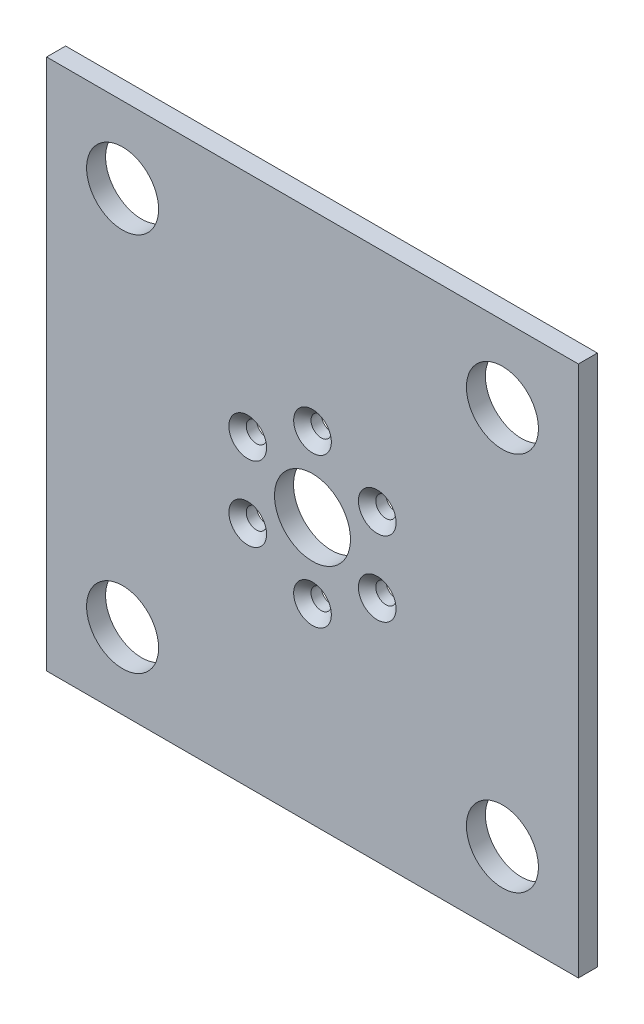
ISO-10303-21;
HEADER;
FILE_DESCRIPTION(('STEP AP214'),'2;1');
FILE_NAME('part.step','',(''),(''),'','','');
FILE_SCHEMA(('AUTOMOTIVE_DESIGN { 1 0 10303 214 1 1 1 1 }'));
ENDSEC;
DATA;
#1=APPLICATION_CONTEXT('core data for automotive mechanical design processes');
#2=APPLICATION_PROTOCOL_DEFINITION('international standard','automotive_design',2000,#1);
#3=PRODUCT_CONTEXT('',#1,'mechanical');
#4=PRODUCT('Part','Part','',(#3));
#5=PRODUCT_RELATED_PRODUCT_CATEGORY('part','',(#4));
#6=PRODUCT_DEFINITION_FORMATION('','',#4);
#7=PRODUCT_DEFINITION_CONTEXT('part definition',#1,'design');
#8=PRODUCT_DEFINITION('design','',#6,#7);
#9=PRODUCT_DEFINITION_SHAPE('','',#8);
#10=(LENGTH_UNIT() NAMED_UNIT(*) SI_UNIT(.MILLI.,.METRE.));
#11=(NAMED_UNIT(*) PLANE_ANGLE_UNIT() SI_UNIT($,.RADIAN.));
#12=(NAMED_UNIT(*) SI_UNIT($,.STERADIAN.) SOLID_ANGLE_UNIT());
#13=UNCERTAINTY_MEASURE_WITH_UNIT(LENGTH_MEASURE(1.E-05),#10,'distance_accuracy_value','');
#14=(GEOMETRIC_REPRESENTATION_CONTEXT(3) GLOBAL_UNCERTAINTY_ASSIGNED_CONTEXT((#13)) GLOBAL_UNIT_ASSIGNED_CONTEXT((#10,
#11,#12)) REPRESENTATION_CONTEXT('',''));
#15=CARTESIAN_POINT('',(0.,0.,0.));
#16=DIRECTION('',(0.,0.,1.));
#17=DIRECTION('',(1.,0.,0.));
#18=AXIS2_PLACEMENT_3D('',#15,#16,#17);
#19=CARTESIAN_POINT('',(44.45,44.45,3.175));
#20=DIRECTION('',(0.,0.,-1.));
#21=DIRECTION('',(-1.,0.,0.));
#22=AXIS2_PLACEMENT_3D('',#19,#20,#21);
#23=PLANE('',#22);
#24=CARTESIAN_POINT('',(-31.75,-31.75,3.175));
#25=DIRECTION('',(0.,0.,-1.));
#26=DIRECTION('',(1.,0.,0.));
#27=AXIS2_PLACEMENT_3D('',#24,#25,#26);
#28=CIRCLE('',#27,6.01891974300622);
#29=CARTESIAN_POINT('',(-25.7310802569938,-31.75,3.175));
#30=VERTEX_POINT('',#29);
#31=EDGE_CURVE('E133',#30,#30,#28,.T.);
#32=ORIENTED_EDGE('',*,*,#31,.T.);
#33=EDGE_LOOP('',(#32));
#34=FACE_BOUND('',#33,.T.);
#35=CARTESIAN_POINT('',(31.75,-31.75,3.175));
#36=DIRECTION('',(0.,0.,1.));
#37=DIRECTION('',(-1.,0.,0.));
#38=AXIS2_PLACEMENT_3D('',#35,#36,#37);
#39=CIRCLE('',#38,6.01891974300622);
#40=CARTESIAN_POINT('',(25.7310802569938,-31.75,3.175));
#41=VERTEX_POINT('',#40);
#42=EDGE_CURVE('E127',#41,#41,#39,.T.);
#43=ORIENTED_EDGE('',*,*,#42,.F.);
#44=EDGE_LOOP('',(#43));
#45=FACE_BOUND('',#44,.T.);
#46=DIRECTION('',(0.,1.,0.));
#47=VECTOR('',#46,1.);
#48=CARTESIAN_POINT('',(44.45,-44.45,3.175));
#49=LINE('',#48,#47);
#50=CARTESIAN_POINT('',(44.45,-44.45,3.175));
#51=VERTEX_POINT('',#50);
#52=CARTESIAN_POINT('',(44.45,44.45,3.175));
#53=VERTEX_POINT('',#52);
#54=EDGE_CURVE('E88',#51,#53,#49,.T.);
#55=ORIENTED_EDGE('',*,*,#54,.T.);
#56=DIRECTION('',(-1.,0.,0.));
#57=VECTOR('',#56,1.);
#58=CARTESIAN_POINT('',(-44.45,44.45,3.175));
#59=LINE('',#58,#57);
#60=CARTESIAN_POINT('',(-44.45,44.45,3.175));
#61=VERTEX_POINT('',#60);
#62=EDGE_CURVE('E83',#53,#61,#59,.T.);
#63=ORIENTED_EDGE('',*,*,#62,.T.);
#64=DIRECTION('',(0.,-1.,0.));
#65=VECTOR('',#64,1.);
#66=CARTESIAN_POINT('',(-44.45,-44.45,3.175));
#67=LINE('',#66,#65);
#68=CARTESIAN_POINT('',(-44.45,-44.45,3.175));
#69=VERTEX_POINT('',#68);
#70=EDGE_CURVE('E86',#61,#69,#67,.T.);
#71=ORIENTED_EDGE('',*,*,#70,.T.);
#72=DIRECTION('',(1.,0.,0.));
#73=VECTOR('',#72,1.);
#74=CARTESIAN_POINT('',(-44.45,-44.45,3.175));
#75=LINE('',#74,#73);
#76=EDGE_CURVE('E53',#69,#51,#75,.T.);
#77=ORIENTED_EDGE('',*,*,#76,.T.);
#78=EDGE_LOOP('',(#55,#63,#71,#77));
#79=FACE_BOUND('',#78,.T.);
#80=CARTESIAN_POINT('',(-31.75,31.75,3.175));
#81=DIRECTION('',(0.,0.,1.));
#82=DIRECTION('',(1.,0.,0.));
#83=AXIS2_PLACEMENT_3D('',#80,#81,#82);
#84=CIRCLE('',#83,6.01891974300622);
#85=CARTESIAN_POINT('',(-25.7310802569938,31.75,3.175));
#86=VERTEX_POINT('',#85);
#87=EDGE_CURVE('E115',#86,#86,#84,.T.);
#88=ORIENTED_EDGE('',*,*,#87,.F.);
#89=EDGE_LOOP('',(#88));
#90=FACE_BOUND('',#89,.T.);
#91=CARTESIAN_POINT('',(31.75,31.75,3.175));
#92=DIRECTION('',(0.,0.,-1.));
#93=DIRECTION('',(-1.,0.,0.));
#94=AXIS2_PLACEMENT_3D('',#91,#92,#93);
#95=CIRCLE('',#94,6.01891974300622);
#96=CARTESIAN_POINT('',(25.7310802569938,31.75,3.175));
#97=VERTEX_POINT('',#96);
#98=EDGE_CURVE('E121',#97,#97,#95,.T.);
#99=ORIENTED_EDGE('',*,*,#98,.T.);
#100=EDGE_LOOP('',(#99));
#101=FACE_BOUND('',#100,.T.);
#102=CARTESIAN_POINT('',(0.,0.,3.175));
#103=DIRECTION('',(0.,0.,1.));
#104=DIRECTION('',(1.,0.,0.));
#105=AXIS2_PLACEMENT_3D('',#102,#103,#104);
#106=CIRCLE('',#105,6.35);
#107=CARTESIAN_POINT('',(6.35,0.,3.175));
#108=VERTEX_POINT('',#107);
#109=EDGE_CURVE('E139',#108,#108,#106,.T.);
#110=ORIENTED_EDGE('',*,*,#109,.F.);
#111=EDGE_LOOP('',(#110));
#112=FACE_BOUND('',#111,.T.);
#113=CARTESIAN_POINT('',(0.,12.5,3.175));
#114=DIRECTION('',(0.,0.,1.));
#115=DIRECTION('',(1.,0.,0.));
#116=AXIS2_PLACEMENT_3D('',#113,#114,#115);
#117=CIRCLE('',#116,3.15);
#118=CARTESIAN_POINT('',(3.15,12.5,3.175));
#119=VERTEX_POINT('',#118);
#120=EDGE_CURVE('E150',#119,#119,#117,.T.);
#121=ORIENTED_EDGE('',*,*,#120,.F.);
#122=EDGE_LOOP('',(#121));
#123=FACE_BOUND('',#122,.T.);
#124=CARTESIAN_POINT('',(-10.8253175473055,6.24999999999998,3.175));
#125=DIRECTION('',(0.,0.,1.));
#126=DIRECTION('',(1.,0.,0.));
#127=AXIS2_PLACEMENT_3D('',#124,#125,#126);
#128=CIRCLE('',#127,3.15);
#129=CARTESIAN_POINT('',(-7.6753175473055,6.24999999999998,3.175));
#130=VERTEX_POINT('',#129);
#131=EDGE_CURVE('E159',#130,#130,#128,.T.);
#132=ORIENTED_EDGE('',*,*,#131,.F.);
#133=EDGE_LOOP('',(#132));
#134=FACE_BOUND('',#133,.T.);
#135=CARTESIAN_POINT('',(-10.8253175473055,-6.25000000000005,3.175));
#136=DIRECTION('',(0.,0.,1.));
#137=DIRECTION('',(1.,0.,0.));
#138=AXIS2_PLACEMENT_3D('',#135,#136,#137);
#139=CIRCLE('',#138,3.15);
#140=CARTESIAN_POINT('',(-7.67531754730546,-6.25000000000005,3.175));
#141=VERTEX_POINT('',#140);
#142=EDGE_CURVE('E168',#141,#141,#139,.T.);
#143=ORIENTED_EDGE('',*,*,#142,.F.);
#144=EDGE_LOOP('',(#143));
#145=FACE_BOUND('',#144,.T.);
#146=CARTESIAN_POINT('',(0.,-12.5,3.175));
#147=DIRECTION('',(0.,0.,1.));
#148=DIRECTION('',(1.,0.,0.));
#149=AXIS2_PLACEMENT_3D('',#146,#147,#148);
#150=CIRCLE('',#149,3.15);
#151=CARTESIAN_POINT('',(3.15,-12.5,3.175));
#152=VERTEX_POINT('',#151);
#153=EDGE_CURVE('E177',#152,#152,#150,.T.);
#154=ORIENTED_EDGE('',*,*,#153,.F.);
#155=EDGE_LOOP('',(#154));
#156=FACE_BOUND('',#155,.T.);
#157=CARTESIAN_POINT('',(10.8253175473055,-6.2499999999999,3.175));
#158=DIRECTION('',(0.,0.,1.));
#159=DIRECTION('',(1.,0.,0.));
#160=AXIS2_PLACEMENT_3D('',#157,#158,#159);
#161=CIRCLE('',#160,3.15);
#162=CARTESIAN_POINT('',(13.9753175473055,-6.2499999999999,3.175));
#163=VERTEX_POINT('',#162);
#164=EDGE_CURVE('E186',#163,#163,#161,.T.);
#165=ORIENTED_EDGE('',*,*,#164,.F.);
#166=EDGE_LOOP('',(#165));
#167=FACE_BOUND('',#166,.T.);
#168=CARTESIAN_POINT('',(10.8253175473054,6.25000000000013,3.175));
#169=DIRECTION('',(0.,0.,1.));
#170=DIRECTION('',(1.,0.,0.));
#171=AXIS2_PLACEMENT_3D('',#168,#169,#170);
#172=CIRCLE('',#171,3.15);
#173=CARTESIAN_POINT('',(13.9753175473054,6.25000000000013,3.175));
#174=VERTEX_POINT('',#173);
#175=EDGE_CURVE('E195',#174,#174,#172,.T.);
#176=ORIENTED_EDGE('',*,*,#175,.F.);
#177=EDGE_LOOP('',(#176));
#178=FACE_BOUND('',#177,.T.);
#179=ADVANCED_FACE('F36',(#34,#45,#79,#90,#101,#112,#123,#134,#145,#156,#167,#178),#23,.F.);
#180=CARTESIAN_POINT('',(44.45,44.45,0.));
#181=DIRECTION('',(0.,0.,-1.));
#182=DIRECTION('',(-1.,0.,0.));
#183=AXIS2_PLACEMENT_3D('',#180,#181,#182);
#184=PLANE('',#183);
#185=CARTESIAN_POINT('',(10.8253175473054,6.25000000000013,0.));
#186=DIRECTION('',(0.,0.,1.));
#187=DIRECTION('',(1.,0.,0.));
#188=AXIS2_PLACEMENT_3D('',#185,#186,#187);
#189=CIRCLE('',#188,1.7);
#190=CARTESIAN_POINT('',(12.5253175473054,6.25000000000013,0.));
#191=VERTEX_POINT('',#190);
#192=EDGE_CURVE('E189',#191,#191,#189,.T.);
#193=ORIENTED_EDGE('',*,*,#192,.T.);
#194=EDGE_LOOP('',(#193));
#195=FACE_BOUND('',#194,.T.);
#196=CARTESIAN_POINT('',(0.,-12.5,0.));
#197=DIRECTION('',(0.,0.,1.));
#198=DIRECTION('',(1.,0.,0.));
#199=AXIS2_PLACEMENT_3D('',#196,#197,#198);
#200=CIRCLE('',#199,1.7);
#201=CARTESIAN_POINT('',(1.7,-12.5,0.));
#202=VERTEX_POINT('',#201);
#203=EDGE_CURVE('E171',#202,#202,#200,.T.);
#204=ORIENTED_EDGE('',*,*,#203,.T.);
#205=EDGE_LOOP('',(#204));
#206=FACE_BOUND('',#205,.T.);
#207=CARTESIAN_POINT('',(-10.8253175473055,-6.25000000000005,0.));
#208=DIRECTION('',(0.,0.,1.));
#209=DIRECTION('',(1.,0.,0.));
#210=AXIS2_PLACEMENT_3D('',#207,#208,#209);
#211=CIRCLE('',#210,1.7);
#212=CARTESIAN_POINT('',(-9.12531754730546,-6.25000000000005,0.));
#213=VERTEX_POINT('',#212);
#214=EDGE_CURVE('E162',#213,#213,#211,.T.);
#215=ORIENTED_EDGE('',*,*,#214,.T.);
#216=EDGE_LOOP('',(#215));
#217=FACE_BOUND('',#216,.T.);
#218=CARTESIAN_POINT('',(-10.8253175473055,6.24999999999998,0.));
#219=DIRECTION('',(0.,0.,1.));
#220=DIRECTION('',(1.,0.,0.));
#221=AXIS2_PLACEMENT_3D('',#218,#219,#220);
#222=CIRCLE('',#221,1.7);
#223=CARTESIAN_POINT('',(-9.1253175473055,6.24999999999998,0.));
#224=VERTEX_POINT('',#223);
#225=EDGE_CURVE('E153',#224,#224,#222,.T.);
#226=ORIENTED_EDGE('',*,*,#225,.T.);
#227=EDGE_LOOP('',(#226));
#228=FACE_BOUND('',#227,.T.);
#229=CARTESIAN_POINT('',(0.,12.5,0.));
#230=DIRECTION('',(0.,0.,1.));
#231=DIRECTION('',(1.,0.,0.));
#232=AXIS2_PLACEMENT_3D('',#229,#230,#231);
#233=CIRCLE('',#232,1.7);
#234=CARTESIAN_POINT('',(1.7,12.5,0.));
#235=VERTEX_POINT('',#234);
#236=EDGE_CURVE('E142',#235,#235,#233,.T.);
#237=ORIENTED_EDGE('',*,*,#236,.T.);
#238=EDGE_LOOP('',(#237));
#239=FACE_BOUND('',#238,.T.);
#240=CARTESIAN_POINT('',(0.,0.,0.));
#241=DIRECTION('',(0.,0.,1.));
#242=DIRECTION('',(1.,0.,0.));
#243=AXIS2_PLACEMENT_3D('',#240,#241,#242);
#244=CIRCLE('',#243,6.35);
#245=CARTESIAN_POINT('',(6.35,0.,0.));
#246=VERTEX_POINT('',#245);
#247=EDGE_CURVE('E136',#246,#246,#244,.T.);
#248=ORIENTED_EDGE('',*,*,#247,.T.);
#249=EDGE_LOOP('',(#248));
#250=FACE_BOUND('',#249,.T.);
#251=CARTESIAN_POINT('',(31.75,31.75,0.));
#252=DIRECTION('',(0.,0.,-1.));
#253=DIRECTION('',(-1.,0.,0.));
#254=AXIS2_PLACEMENT_3D('',#251,#252,#253);
#255=CIRCLE('',#254,6.01891974300622);
#256=CARTESIAN_POINT('',(25.7310802569938,31.75,0.));
#257=VERTEX_POINT('',#256);
#258=EDGE_CURVE('E118',#257,#257,#255,.T.);
#259=ORIENTED_EDGE('',*,*,#258,.F.);
#260=EDGE_LOOP('',(#259));
#261=FACE_BOUND('',#260,.T.);
#262=CARTESIAN_POINT('',(-31.75,31.75,0.));
#263=DIRECTION('',(0.,0.,1.));
#264=DIRECTION('',(1.,0.,0.));
#265=AXIS2_PLACEMENT_3D('',#262,#263,#264);
#266=CIRCLE('',#265,6.01891974300622);
#267=CARTESIAN_POINT('',(-25.7310802569938,31.75,0.));
#268=VERTEX_POINT('',#267);
#269=EDGE_CURVE('E103',#268,#268,#266,.T.);
#270=ORIENTED_EDGE('',*,*,#269,.T.);
#271=EDGE_LOOP('',(#270));
#272=FACE_BOUND('',#271,.T.);
#273=DIRECTION('',(0.,1.,0.));
#274=VECTOR('',#273,1.);
#275=CARTESIAN_POINT('',(44.45,-44.45,0.));
#276=LINE('',#275,#274);
#277=CARTESIAN_POINT('',(44.45,-44.45,0.));
#278=VERTEX_POINT('',#277);
#279=CARTESIAN_POINT('',(44.45,44.45,0.));
#280=VERTEX_POINT('',#279);
#281=EDGE_CURVE('E100',#278,#280,#276,.T.);
#282=ORIENTED_EDGE('',*,*,#281,.F.);
#283=DIRECTION('',(1.,0.,0.));
#284=VECTOR('',#283,1.);
#285=CARTESIAN_POINT('',(-44.45,-44.45,0.));
#286=LINE('',#285,#284);
#287=CARTESIAN_POINT('',(-44.45,-44.45,0.));
#288=VERTEX_POINT('',#287);
#289=EDGE_CURVE('E76',#288,#278,#286,.T.);
#290=ORIENTED_EDGE('',*,*,#289,.F.);
#291=DIRECTION('',(0.,-1.,0.));
#292=VECTOR('',#291,1.);
#293=CARTESIAN_POINT('',(-44.45,-44.45,0.));
#294=LINE('',#293,#292);
#295=CARTESIAN_POINT('',(-44.45,44.45,0.));
#296=VERTEX_POINT('',#295);
#297=EDGE_CURVE('E70',#296,#288,#294,.T.);
#298=ORIENTED_EDGE('',*,*,#297,.F.);
#299=DIRECTION('',(-1.,0.,0.));
#300=VECTOR('',#299,1.);
#301=CARTESIAN_POINT('',(-44.45,44.45,0.));
#302=LINE('',#301,#300);
#303=EDGE_CURVE('E92',#280,#296,#302,.T.);
#304=ORIENTED_EDGE('',*,*,#303,.F.);
#305=EDGE_LOOP('',(#282,#290,#298,#304));
#306=FACE_BOUND('',#305,.T.);
#307=CARTESIAN_POINT('',(31.75,-31.75,0.));
#308=DIRECTION('',(0.,0.,1.));
#309=DIRECTION('',(-1.,0.,0.));
#310=AXIS2_PLACEMENT_3D('',#307,#308,#309);
#311=CIRCLE('',#310,6.01891974300622);
#312=CARTESIAN_POINT('',(25.7310802569938,-31.75,0.));
#313=VERTEX_POINT('',#312);
#314=EDGE_CURVE('E124',#313,#313,#311,.T.);
#315=ORIENTED_EDGE('',*,*,#314,.T.);
#316=EDGE_LOOP('',(#315));
#317=FACE_BOUND('',#316,.T.);
#318=CARTESIAN_POINT('',(-31.75,-31.75,0.));
#319=DIRECTION('',(0.,0.,-1.));
#320=DIRECTION('',(1.,0.,0.));
#321=AXIS2_PLACEMENT_3D('',#318,#319,#320);
#322=CIRCLE('',#321,6.01891974300622);
#323=CARTESIAN_POINT('',(-25.7310802569938,-31.75,0.));
#324=VERTEX_POINT('',#323);
#325=EDGE_CURVE('E130',#324,#324,#322,.T.);
#326=ORIENTED_EDGE('',*,*,#325,.F.);
#327=EDGE_LOOP('',(#326));
#328=FACE_BOUND('',#327,.T.);
#329=CARTESIAN_POINT('',(10.8253175473055,-6.2499999999999,0.));
#330=DIRECTION('',(0.,0.,1.));
#331=DIRECTION('',(1.,0.,0.));
#332=AXIS2_PLACEMENT_3D('',#329,#330,#331);
#333=CIRCLE('',#332,1.7);
#334=CARTESIAN_POINT('',(12.5253175473055,-6.2499999999999,0.));
#335=VERTEX_POINT('',#334);
#336=EDGE_CURVE('E180',#335,#335,#333,.T.);
#337=ORIENTED_EDGE('',*,*,#336,.T.);
#338=EDGE_LOOP('',(#337));
#339=FACE_BOUND('',#338,.T.);
#340=ADVANCED_FACE('F111',(#195,#206,#217,#228,#239,#250,#261,#272,#306,#317,#328,#339),#184,.T.);
#341=CARTESIAN_POINT('',(44.45,-44.45,3.175));
#342=DIRECTION('',(-1.,0.,0.));
#343=DIRECTION('',(0.,0.,1.));
#344=AXIS2_PLACEMENT_3D('',#341,#342,#343);
#345=PLANE('',#344);
#346=ORIENTED_EDGE('',*,*,#281,.T.);
#347=DIRECTION('',(0.,0.,-1.));
#348=VECTOR('',#347,1.);
#349=CARTESIAN_POINT('',(44.45,44.45,3.175));
#350=LINE('',#349,#348);
#351=EDGE_CURVE('E11',#53,#280,#350,.T.);
#352=ORIENTED_EDGE('',*,*,#351,.F.);
#353=ORIENTED_EDGE('',*,*,#54,.F.);
#354=DIRECTION('',(0.,0.,-1.));
#355=VECTOR('',#354,1.);
#356=CARTESIAN_POINT('',(44.45,-44.45,3.175));
#357=LINE('',#356,#355);
#358=EDGE_CURVE('E96',#51,#278,#357,.T.);
#359=ORIENTED_EDGE('',*,*,#358,.T.);
#360=EDGE_LOOP('',(#346,#352,#353,#359));
#361=FACE_BOUND('',#360,.T.);
#362=ADVANCED_FACE('F38',(#361),#345,.F.);
#363=CARTESIAN_POINT('',(-44.45,44.45,3.175));
#364=DIRECTION('',(0.,-1.,0.));
#365=DIRECTION('',(0.,0.,-1.));
#366=AXIS2_PLACEMENT_3D('',#363,#364,#365);
#367=PLANE('',#366);
#368=ORIENTED_EDGE('',*,*,#303,.T.);
#369=DIRECTION('',(0.,0.,-1.));
#370=VECTOR('',#369,1.);
#371=CARTESIAN_POINT('',(-44.45,44.45,3.175));
#372=LINE('',#371,#370);
#373=EDGE_CURVE('E45',#61,#296,#372,.T.);
#374=ORIENTED_EDGE('',*,*,#373,.F.);
#375=ORIENTED_EDGE('',*,*,#62,.F.);
#376=ORIENTED_EDGE('',*,*,#351,.T.);
#377=EDGE_LOOP('',(#368,#374,#375,#376));
#378=FACE_BOUND('',#377,.T.);
#379=ADVANCED_FACE('F91',(#378),#367,.F.);
#380=CARTESIAN_POINT('',(-44.45,-44.45,3.175));
#381=DIRECTION('',(1.,0.,0.));
#382=DIRECTION('',(0.,0.,-1.));
#383=AXIS2_PLACEMENT_3D('',#380,#381,#382);
#384=PLANE('',#383);
#385=ORIENTED_EDGE('',*,*,#297,.T.);
#386=DIRECTION('',(0.,0.,-1.));
#387=VECTOR('',#386,1.);
#388=CARTESIAN_POINT('',(-44.45,-44.45,3.175));
#389=LINE('',#388,#387);
#390=EDGE_CURVE('E93',#69,#288,#389,.T.);
#391=ORIENTED_EDGE('',*,*,#390,.F.);
#392=ORIENTED_EDGE('',*,*,#70,.F.);
#393=ORIENTED_EDGE('',*,*,#373,.T.);
#394=EDGE_LOOP('',(#385,#391,#392,#393));
#395=FACE_BOUND('',#394,.T.);
#396=ADVANCED_FACE('F94',(#395),#384,.F.);
#397=CARTESIAN_POINT('',(-44.45,-44.45,3.175));
#398=DIRECTION('',(0.,1.,0.));
#399=DIRECTION('',(0.,0.,1.));
#400=AXIS2_PLACEMENT_3D('',#397,#398,#399);
#401=PLANE('',#400);
#402=ORIENTED_EDGE('',*,*,#289,.T.);
#403=ORIENTED_EDGE('',*,*,#358,.F.);
#404=ORIENTED_EDGE('',*,*,#76,.F.);
#405=ORIENTED_EDGE('',*,*,#390,.T.);
#406=EDGE_LOOP('',(#402,#403,#404,#405));
#407=FACE_BOUND('',#406,.T.);
#408=ADVANCED_FACE('F108',(#407),#401,.F.);
#409=CARTESIAN_POINT('',(-31.75,31.75,0.));
#410=DIRECTION('',(0.,0.,1.));
#411=DIRECTION('',(1.,0.,0.));
#412=AXIS2_PLACEMENT_3D('',#409,#410,#411);
#413=CYLINDRICAL_SURFACE('',#412,6.01891974300622);
#414=ORIENTED_EDGE('',*,*,#269,.F.);
#415=EDGE_LOOP('',(#414));
#416=FACE_BOUND('',#415,.T.);
#417=ORIENTED_EDGE('',*,*,#87,.T.);
#418=EDGE_LOOP('',(#417));
#419=FACE_BOUND('',#418,.T.);
#420=ADVANCED_FACE('F211',(#416,#419),#413,.F.);
#421=CARTESIAN_POINT('',(31.75,31.75,0.));
#422=DIRECTION('',(0.,0.,1.));
#423=DIRECTION('',(1.,0.,0.));
#424=AXIS2_PLACEMENT_3D('',#421,#422,#423);
#425=CYLINDRICAL_SURFACE('',#424,6.01891974300622);
#426=ORIENTED_EDGE('',*,*,#258,.T.);
#427=EDGE_LOOP('',(#426));
#428=FACE_BOUND('',#427,.T.);
#429=ORIENTED_EDGE('',*,*,#98,.F.);
#430=EDGE_LOOP('',(#429));
#431=FACE_BOUND('',#430,.T.);
#432=ADVANCED_FACE('F285',(#428,#431),#425,.F.);
#433=CARTESIAN_POINT('',(31.75,-31.75,0.));
#434=DIRECTION('',(0.,0.,1.));
#435=DIRECTION('',(1.,0.,0.));
#436=AXIS2_PLACEMENT_3D('',#433,#434,#435);
#437=CYLINDRICAL_SURFACE('',#436,6.01891974300622);
#438=ORIENTED_EDGE('',*,*,#314,.F.);
#439=EDGE_LOOP('',(#438));
#440=FACE_BOUND('',#439,.T.);
#441=ORIENTED_EDGE('',*,*,#42,.T.);
#442=EDGE_LOOP('',(#441));
#443=FACE_BOUND('',#442,.T.);
#444=ADVANCED_FACE('F275',(#440,#443),#437,.F.);
#445=CARTESIAN_POINT('',(-31.75,-31.75,0.));
#446=DIRECTION('',(0.,0.,1.));
#447=DIRECTION('',(1.,0.,0.));
#448=AXIS2_PLACEMENT_3D('',#445,#446,#447);
#449=CYLINDRICAL_SURFACE('',#448,6.01891974300622);
#450=ORIENTED_EDGE('',*,*,#325,.T.);
#451=EDGE_LOOP('',(#450));
#452=FACE_BOUND('',#451,.T.);
#453=ORIENTED_EDGE('',*,*,#31,.F.);
#454=EDGE_LOOP('',(#453));
#455=FACE_BOUND('',#454,.T.);
#456=ADVANCED_FACE('F265',(#452,#455),#449,.F.);
#457=CARTESIAN_POINT('',(0.,0.,0.));
#458=DIRECTION('',(0.,0.,1.));
#459=DIRECTION('',(1.,0.,0.));
#460=AXIS2_PLACEMENT_3D('',#457,#458,#459);
#461=CYLINDRICAL_SURFACE('',#460,6.35);
#462=ORIENTED_EDGE('',*,*,#247,.F.);
#463=EDGE_LOOP('',(#462));
#464=FACE_BOUND('',#463,.T.);
#465=ORIENTED_EDGE('',*,*,#109,.T.);
#466=EDGE_LOOP('',(#465));
#467=FACE_BOUND('',#466,.T.);
#468=ADVANCED_FACE('F255',(#464,#467),#461,.F.);
#469=CARTESIAN_POINT('',(0.,12.5,3.175));
#470=DIRECTION('',(0.,0.,1.));
#471=DIRECTION('',(1.,0.,0.));
#472=AXIS2_PLACEMENT_3D('',#469,#470,#471);
#473=CYLINDRICAL_SURFACE('',#472,1.7);
#474=ORIENTED_EDGE('',*,*,#236,.F.);
#475=EDGE_LOOP('',(#474));
#476=FACE_BOUND('',#475,.T.);
#477=CARTESIAN_POINT('',(0.,12.5,1.725));
#478=DIRECTION('',(0.,0.,1.));
#479=DIRECTION('',(1.,0.,0.));
#480=AXIS2_PLACEMENT_3D('',#477,#478,#479);
#481=CIRCLE('',#480,1.7);
#482=CARTESIAN_POINT('',(1.7,12.5,1.725));
#483=VERTEX_POINT('',#482);
#484=EDGE_CURVE('E147',#483,#483,#481,.T.);
#485=ORIENTED_EDGE('',*,*,#484,.T.);
#486=EDGE_LOOP('',(#485));
#487=FACE_BOUND('',#486,.T.);
#488=ADVANCED_FACE('F244',(#476,#487),#473,.F.);
#489=CARTESIAN_POINT('',(0.,12.5,3.175));
#490=DIRECTION('',(0.,0.,1.));
#491=DIRECTION('',(1.,0.,0.));
#492=AXIS2_PLACEMENT_3D('',#489,#490,#491);
#493=CONICAL_SURFACE('',#492,3.15,0.785398163397449);
#494=ORIENTED_EDGE('',*,*,#484,.F.);
#495=EDGE_LOOP('',(#494));
#496=FACE_BOUND('',#495,.T.);
#497=ORIENTED_EDGE('',*,*,#120,.T.);
#498=EDGE_LOOP('',(#497));
#499=FACE_BOUND('',#498,.T.);
#500=ADVANCED_FACE('F238',(#496,#499),#493,.F.);
#501=CARTESIAN_POINT('',(-10.8253175473055,6.24999999999998,3.175));
#502=DIRECTION('',(0.,0.,1.));
#503=DIRECTION('',(1.,0.,0.));
#504=AXIS2_PLACEMENT_3D('',#501,#502,#503);
#505=CYLINDRICAL_SURFACE('',#504,1.7);
#506=ORIENTED_EDGE('',*,*,#225,.F.);
#507=EDGE_LOOP('',(#506));
#508=FACE_BOUND('',#507,.T.);
#509=CARTESIAN_POINT('',(-10.8253175473055,6.24999999999998,1.725));
#510=DIRECTION('',(0.,0.,1.));
#511=DIRECTION('',(1.,0.,0.));
#512=AXIS2_PLACEMENT_3D('',#509,#510,#511);
#513=CIRCLE('',#512,1.7);
#514=CARTESIAN_POINT('',(-9.1253175473055,6.24999999999998,1.725));
#515=VERTEX_POINT('',#514);
#516=EDGE_CURVE('E156',#515,#515,#513,.T.);
#517=ORIENTED_EDGE('',*,*,#516,.T.);
#518=EDGE_LOOP('',(#517));
#519=FACE_BOUND('',#518,.T.);
#520=ADVANCED_FACE('F243',(#508,#519),#505,.F.);
#521=CARTESIAN_POINT('',(-10.8253175473055,6.24999999999998,3.175));
#522=DIRECTION('',(0.,0.,1.));
#523=DIRECTION('',(1.,0.,0.));
#524=AXIS2_PLACEMENT_3D('',#521,#522,#523);
#525=CONICAL_SURFACE('',#524,3.15,0.785398163397449);
#526=ORIENTED_EDGE('',*,*,#516,.F.);
#527=EDGE_LOOP('',(#526));
#528=FACE_BOUND('',#527,.T.);
#529=ORIENTED_EDGE('',*,*,#131,.T.);
#530=EDGE_LOOP('',(#529));
#531=FACE_BOUND('',#530,.T.);
#532=ADVANCED_FACE('F374',(#528,#531),#525,.F.);
#533=CARTESIAN_POINT('',(-10.8253175473055,-6.25000000000005,3.175));
#534=DIRECTION('',(0.,0.,1.));
#535=DIRECTION('',(1.,0.,0.));
#536=AXIS2_PLACEMENT_3D('',#533,#534,#535);
#537=CYLINDRICAL_SURFACE('',#536,1.7);
#538=ORIENTED_EDGE('',*,*,#214,.F.);
#539=EDGE_LOOP('',(#538));
#540=FACE_BOUND('',#539,.T.);
#541=CARTESIAN_POINT('',(-10.8253175473055,-6.25000000000005,1.725));
#542=DIRECTION('',(0.,0.,1.));
#543=DIRECTION('',(1.,0.,0.));
#544=AXIS2_PLACEMENT_3D('',#541,#542,#543);
#545=CIRCLE('',#544,1.7);
#546=CARTESIAN_POINT('',(-9.12531754730546,-6.25000000000005,1.725));
#547=VERTEX_POINT('',#546);
#548=EDGE_CURVE('E165',#547,#547,#545,.T.);
#549=ORIENTED_EDGE('',*,*,#548,.T.);
#550=EDGE_LOOP('',(#549));
#551=FACE_BOUND('',#550,.T.);
#552=ADVANCED_FACE('F370',(#540,#551),#537,.F.);
#553=CARTESIAN_POINT('',(-10.8253175473055,-6.25000000000005,3.175));
#554=DIRECTION('',(0.,0.,1.));
#555=DIRECTION('',(1.,0.,0.));
#556=AXIS2_PLACEMENT_3D('',#553,#554,#555);
#557=CONICAL_SURFACE('',#556,3.15,0.785398163397449);
#558=ORIENTED_EDGE('',*,*,#548,.F.);
#559=EDGE_LOOP('',(#558));
#560=FACE_BOUND('',#559,.T.);
#561=ORIENTED_EDGE('',*,*,#142,.T.);
#562=EDGE_LOOP('',(#561));
#563=FACE_BOUND('',#562,.T.);
#564=ADVANCED_FACE('F366',(#560,#563),#557,.F.);
#565=CARTESIAN_POINT('',(0.,-12.5,3.175));
#566=DIRECTION('',(0.,0.,1.));
#567=DIRECTION('',(1.,0.,0.));
#568=AXIS2_PLACEMENT_3D('',#565,#566,#567);
#569=CYLINDRICAL_SURFACE('',#568,1.7);
#570=ORIENTED_EDGE('',*,*,#203,.F.);
#571=EDGE_LOOP('',(#570));
#572=FACE_BOUND('',#571,.T.);
#573=CARTESIAN_POINT('',(0.,-12.5,1.725));
#574=DIRECTION('',(0.,0.,1.));
#575=DIRECTION('',(1.,0.,0.));
#576=AXIS2_PLACEMENT_3D('',#573,#574,#575);
#577=CIRCLE('',#576,1.7);
#578=CARTESIAN_POINT('',(1.7,-12.5,1.725));
#579=VERTEX_POINT('',#578);
#580=EDGE_CURVE('E174',#579,#579,#577,.T.);
#581=ORIENTED_EDGE('',*,*,#580,.T.);
#582=EDGE_LOOP('',(#581));
#583=FACE_BOUND('',#582,.T.);
#584=ADVANCED_FACE('F362',(#572,#583),#569,.F.);
#585=CARTESIAN_POINT('',(0.,-12.5,3.175));
#586=DIRECTION('',(0.,0.,1.));
#587=DIRECTION('',(1.,0.,0.));
#588=AXIS2_PLACEMENT_3D('',#585,#586,#587);
#589=CONICAL_SURFACE('',#588,3.15,0.785398163397449);
#590=ORIENTED_EDGE('',*,*,#580,.F.);
#591=EDGE_LOOP('',(#590));
#592=FACE_BOUND('',#591,.T.);
#593=ORIENTED_EDGE('',*,*,#153,.T.);
#594=EDGE_LOOP('',(#593));
#595=FACE_BOUND('',#594,.T.);
#596=ADVANCED_FACE('F354',(#592,#595),#589,.F.);
#597=CARTESIAN_POINT('',(10.8253175473055,-6.2499999999999,3.175));
#598=DIRECTION('',(0.,0.,1.));
#599=DIRECTION('',(1.,0.,0.));
#600=AXIS2_PLACEMENT_3D('',#597,#598,#599);
#601=CYLINDRICAL_SURFACE('',#600,1.7);
#602=ORIENTED_EDGE('',*,*,#336,.F.);
#603=EDGE_LOOP('',(#602));
#604=FACE_BOUND('',#603,.T.);
#605=CARTESIAN_POINT('',(10.8253175473055,-6.2499999999999,1.725));
#606=DIRECTION('',(0.,0.,1.));
#607=DIRECTION('',(1.,0.,0.));
#608=AXIS2_PLACEMENT_3D('',#605,#606,#607);
#609=CIRCLE('',#608,1.7);
#610=CARTESIAN_POINT('',(12.5253175473055,-6.2499999999999,1.725));
#611=VERTEX_POINT('',#610);
#612=EDGE_CURVE('E183',#611,#611,#609,.T.);
#613=ORIENTED_EDGE('',*,*,#612,.T.);
#614=EDGE_LOOP('',(#613));
#615=FACE_BOUND('',#614,.T.);
#616=ADVANCED_FACE('F345',(#604,#615),#601,.F.);
#617=CARTESIAN_POINT('',(10.8253175473055,-6.2499999999999,3.175));
#618=DIRECTION('',(0.,0.,1.));
#619=DIRECTION('',(1.,0.,0.));
#620=AXIS2_PLACEMENT_3D('',#617,#618,#619);
#621=CONICAL_SURFACE('',#620,3.15,0.785398163397449);
#622=ORIENTED_EDGE('',*,*,#612,.F.);
#623=EDGE_LOOP('',(#622));
#624=FACE_BOUND('',#623,.T.);
#625=ORIENTED_EDGE('',*,*,#164,.T.);
#626=EDGE_LOOP('',(#625));
#627=FACE_BOUND('',#626,.T.);
#628=ADVANCED_FACE('F342',(#624,#627),#621,.F.);
#629=CARTESIAN_POINT('',(10.8253175473054,6.25000000000013,3.175));
#630=DIRECTION('',(0.,0.,1.));
#631=DIRECTION('',(1.,0.,0.));
#632=AXIS2_PLACEMENT_3D('',#629,#630,#631);
#633=CYLINDRICAL_SURFACE('',#632,1.7);
#634=ORIENTED_EDGE('',*,*,#192,.F.);
#635=EDGE_LOOP('',(#634));
#636=FACE_BOUND('',#635,.T.);
#637=CARTESIAN_POINT('',(10.8253175473054,6.25000000000013,1.725));
#638=DIRECTION('',(0.,0.,1.));
#639=DIRECTION('',(1.,0.,0.));
#640=AXIS2_PLACEMENT_3D('',#637,#638,#639);
#641=CIRCLE('',#640,1.7);
#642=CARTESIAN_POINT('',(12.5253175473054,6.25000000000013,1.725));
#643=VERTEX_POINT('',#642);
#644=EDGE_CURVE('E192',#643,#643,#641,.T.);
#645=ORIENTED_EDGE('',*,*,#644,.T.);
#646=EDGE_LOOP('',(#645));
#647=FACE_BOUND('',#646,.T.);
#648=ADVANCED_FACE('F344',(#636,#647),#633,.F.);
#649=CARTESIAN_POINT('',(10.8253175473054,6.25000000000013,3.175));
#650=DIRECTION('',(0.,0.,1.));
#651=DIRECTION('',(1.,0.,0.));
#652=AXIS2_PLACEMENT_3D('',#649,#650,#651);
#653=CONICAL_SURFACE('',#652,3.15,0.785398163397449);
#654=ORIENTED_EDGE('',*,*,#644,.F.);
#655=EDGE_LOOP('',(#654));
#656=FACE_BOUND('',#655,.T.);
#657=ORIENTED_EDGE('',*,*,#175,.T.);
#658=EDGE_LOOP('',(#657));
#659=FACE_BOUND('',#658,.T.);
#660=ADVANCED_FACE('F199',(#656,#659),#653,.F.);
#661=CLOSED_SHELL('',(#179,#340,#362,#379,#396,#408,#420,#432,#444,#456,#468,#488,#500,#520,
#532,#552,#564,#584,#596,#616,#628,#648,#660));
#662=MANIFOLD_SOLID_BREP('B2',#661);
#663=ADVANCED_BREP_SHAPE_REPRESENTATION('',(#18,#662),#14);
#664=SHAPE_DEFINITION_REPRESENTATION(#9,#663);
ENDSEC;
END-ISO-10303-21;
